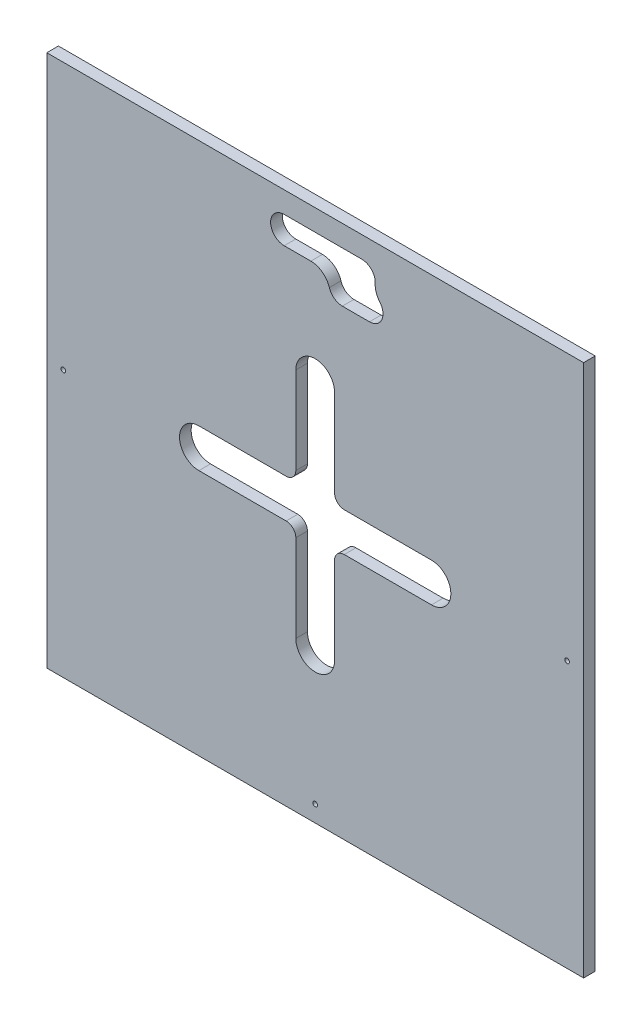
ISO-10303-21;
HEADER;
FILE_DESCRIPTION(('STEP AP214'),'2;1');
FILE_NAME('part.step','',(''),(''),'','','');
FILE_SCHEMA(('AUTOMOTIVE_DESIGN { 1 0 10303 214 1 1 1 1 }'));
ENDSEC;
DATA;
#1=APPLICATION_CONTEXT('core data for automotive mechanical design processes');
#2=APPLICATION_PROTOCOL_DEFINITION('international standard','automotive_design',2000,#1);
#3=PRODUCT_CONTEXT('',#1,'mechanical');
#4=PRODUCT('Part','Part','',(#3));
#5=PRODUCT_RELATED_PRODUCT_CATEGORY('part','',(#4));
#6=PRODUCT_DEFINITION_FORMATION('','',#4);
#7=PRODUCT_DEFINITION_CONTEXT('part definition',#1,'design');
#8=PRODUCT_DEFINITION('design','',#6,#7);
#9=PRODUCT_DEFINITION_SHAPE('','',#8);
#10=(LENGTH_UNIT() NAMED_UNIT(*) SI_UNIT(.MILLI.,.METRE.));
#11=(NAMED_UNIT(*) PLANE_ANGLE_UNIT() SI_UNIT($,.RADIAN.));
#12=(NAMED_UNIT(*) SI_UNIT($,.STERADIAN.) SOLID_ANGLE_UNIT());
#13=UNCERTAINTY_MEASURE_WITH_UNIT(LENGTH_MEASURE(1.E-05),#10,'distance_accuracy_value','');
#14=(GEOMETRIC_REPRESENTATION_CONTEXT(3) GLOBAL_UNCERTAINTY_ASSIGNED_CONTEXT((#13)) GLOBAL_UNIT_ASSIGNED_CONTEXT((#10,
#11,#12)) REPRESENTATION_CONTEXT('',''));
#15=CARTESIAN_POINT('',(0.,0.,0.));
#16=DIRECTION('',(0.,0.,1.));
#17=DIRECTION('',(1.,0.,0.));
#18=AXIS2_PLACEMENT_3D('',#15,#16,#17);
#19=CARTESIAN_POINT('',(-9.99999999999998,60.,0.));
#20=DIRECTION('',(-1.,0.,0.));
#21=DIRECTION('',(0.,-1.,0.));
#22=AXIS2_PLACEMENT_3D('',#19,#20,#21);
#23=PLANE('',#22);
#24=DIRECTION('',(0.,1.,0.));
#25=VECTOR('',#24,1.);
#26=CARTESIAN_POINT('',(-9.99999999999998,60.,0.));
#27=LINE('',#26,#25);
#28=CARTESIAN_POINT('',(-9.99999999999999,15.0000000000001,0.));
#29=VERTEX_POINT('',#28);
#30=CARTESIAN_POINT('',(-9.99999999999998,60.,0.));
#31=VERTEX_POINT('',#30);
#32=EDGE_CURVE('E292',#29,#31,#27,.T.);
#33=ORIENTED_EDGE('',*,*,#32,.F.);
#34=DIRECTION('',(0.,0.,-1.));
#35=VECTOR('',#34,1.);
#36=CARTESIAN_POINT('',(-9.99999999999999,15.0000000000001,0.));
#37=LINE('',#36,#35);
#38=CARTESIAN_POINT('',(-9.99999999999999,15.0000000000001,-6.));
#39=VERTEX_POINT('',#38);
#40=EDGE_CURVE('E452',#29,#39,#37,.T.);
#41=ORIENTED_EDGE('',*,*,#40,.T.);
#42=DIRECTION('',(0.,1.,0.));
#43=VECTOR('',#42,1.);
#44=CARTESIAN_POINT('',(-9.99999999999998,60.,-6.));
#45=LINE('',#44,#43);
#46=CARTESIAN_POINT('',(-9.99999999999998,60.,-6.));
#47=VERTEX_POINT('',#46);
#48=EDGE_CURVE('E305',#39,#47,#45,.T.);
#49=ORIENTED_EDGE('',*,*,#48,.T.);
#50=DIRECTION('',(0.,0.,-1.));
#51=VECTOR('',#50,1.);
#52=CARTESIAN_POINT('',(-9.99999999999998,60.,0.));
#53=LINE('',#52,#51);
#54=EDGE_CURVE('E308',#31,#47,#53,.T.);
#55=ORIENTED_EDGE('',*,*,#54,.F.);
#56=EDGE_LOOP('',(#33,#41,#49,#55));
#57=FACE_BOUND('',#56,.T.);
#58=ADVANCED_FACE('F38',(#57),#23,.F.);
#59=CARTESIAN_POINT('',(10.,60.,0.));
#60=DIRECTION('',(1.,0.,0.));
#61=DIRECTION('',(0.,1.,0.));
#62=AXIS2_PLACEMENT_3D('',#59,#60,#61);
#63=PLANE('',#62);
#64=DIRECTION('',(0.,-1.,0.));
#65=VECTOR('',#64,1.);
#66=CARTESIAN_POINT('',(10.,60.,-6.));
#67=LINE('',#66,#65);
#68=CARTESIAN_POINT('',(10.,60.,-6.));
#69=VERTEX_POINT('',#68);
#70=CARTESIAN_POINT('',(10.,14.9999999999999,-6.));
#71=VERTEX_POINT('',#70);
#72=EDGE_CURVE('E299',#69,#71,#67,.T.);
#73=ORIENTED_EDGE('',*,*,#72,.T.);
#74=DIRECTION('',(0.,0.,1.));
#75=VECTOR('',#74,1.);
#76=CARTESIAN_POINT('',(10.,14.9999999999999,0.));
#77=LINE('',#76,#75);
#78=CARTESIAN_POINT('',(10.,14.9999999999999,0.));
#79=VERTEX_POINT('',#78);
#80=EDGE_CURVE('E46',#71,#79,#77,.T.);
#81=ORIENTED_EDGE('',*,*,#80,.T.);
#82=DIRECTION('',(0.,-1.,0.));
#83=VECTOR('',#82,1.);
#84=CARTESIAN_POINT('',(10.,60.,0.));
#85=LINE('',#84,#83);
#86=CARTESIAN_POINT('',(10.,60.,0.));
#87=VERTEX_POINT('',#86);
#88=EDGE_CURVE('E286',#87,#79,#85,.T.);
#89=ORIENTED_EDGE('',*,*,#88,.F.);
#90=DIRECTION('',(0.,0.,-1.));
#91=VECTOR('',#90,1.);
#92=CARTESIAN_POINT('',(10.,60.,0.));
#93=LINE('',#92,#91);
#94=EDGE_CURVE('E296',#87,#69,#93,.T.);
#95=ORIENTED_EDGE('',*,*,#94,.T.);
#96=EDGE_LOOP('',(#73,#81,#89,#95));
#97=FACE_BOUND('',#96,.T.);
#98=ADVANCED_FACE('F463',(#97),#63,.F.);
#99=CARTESIAN_POINT('',(138.5,137.5,-6.));
#100=DIRECTION('',(1.,0.,0.));
#101=DIRECTION('',(0.,1.,0.));
#102=AXIS2_PLACEMENT_3D('',#99,#100,#101);
#103=PLANE('',#102);
#104=DIRECTION('',(0.,1.,0.));
#105=VECTOR('',#104,1.);
#106=CARTESIAN_POINT('',(138.5,137.5,0.));
#107=LINE('',#106,#105);
#108=CARTESIAN_POINT('',(138.5,-137.5,0.));
#109=VERTEX_POINT('',#108);
#110=CARTESIAN_POINT('',(138.5,137.5,0.));
#111=VERTEX_POINT('',#110);
#112=EDGE_CURVE('E359',#109,#111,#107,.T.);
#113=ORIENTED_EDGE('',*,*,#112,.F.);
#114=DIRECTION('',(0.,0.,1.));
#115=VECTOR('',#114,1.);
#116=CARTESIAN_POINT('',(138.5,-137.5,-6.));
#117=LINE('',#116,#115);
#118=CARTESIAN_POINT('',(138.5,-137.5,-6.));
#119=VERTEX_POINT('',#118);
#120=EDGE_CURVE('E392',#119,#109,#117,.T.);
#121=ORIENTED_EDGE('',*,*,#120,.F.);
#122=DIRECTION('',(0.,1.,0.));
#123=VECTOR('',#122,1.);
#124=CARTESIAN_POINT('',(138.5,137.5,-6.));
#125=LINE('',#124,#123);
#126=CARTESIAN_POINT('',(138.5,137.5,-6.));
#127=VERTEX_POINT('',#126);
#128=EDGE_CURVE('E368',#119,#127,#125,.T.);
#129=ORIENTED_EDGE('',*,*,#128,.T.);
#130=DIRECTION('',(0.,0.,1.));
#131=VECTOR('',#130,1.);
#132=CARTESIAN_POINT('',(138.5,137.5,-6.));
#133=LINE('',#132,#131);
#134=EDGE_CURVE('E381',#127,#111,#133,.T.);
#135=ORIENTED_EDGE('',*,*,#134,.T.);
#136=EDGE_LOOP('',(#113,#121,#129,#135));
#137=FACE_BOUND('',#136,.T.);
#138=ADVANCED_FACE('F531',(#137),#103,.T.);
#139=CARTESIAN_POINT('',(-138.5,-137.5,-6.));
#140=DIRECTION('',(0.,-1.,0.));
#141=DIRECTION('',(0.,0.,-1.));
#142=AXIS2_PLACEMENT_3D('',#139,#140,#141);
#143=PLANE('',#142);
#144=DIRECTION('',(1.,0.,0.));
#145=VECTOR('',#144,1.);
#146=CARTESIAN_POINT('',(-138.5,-137.5,0.));
#147=LINE('',#146,#145);
#148=CARTESIAN_POINT('',(-138.5,-137.5,0.));
#149=VERTEX_POINT('',#148);
#150=EDGE_CURVE('E372',#149,#109,#147,.T.);
#151=ORIENTED_EDGE('',*,*,#150,.F.);
#152=DIRECTION('',(0.,0.,1.));
#153=VECTOR('',#152,1.);
#154=CARTESIAN_POINT('',(-138.5,-137.5,-6.));
#155=LINE('',#154,#153);
#156=CARTESIAN_POINT('',(-138.5,-137.5,-6.));
#157=VERTEX_POINT('',#156);
#158=EDGE_CURVE('E395',#157,#149,#155,.T.);
#159=ORIENTED_EDGE('',*,*,#158,.F.);
#160=DIRECTION('',(1.,0.,0.));
#161=VECTOR('',#160,1.);
#162=CARTESIAN_POINT('',(-138.5,-137.5,-6.));
#163=LINE('',#162,#161);
#164=EDGE_CURVE('E378',#157,#119,#163,.T.);
#165=ORIENTED_EDGE('',*,*,#164,.T.);
#166=ORIENTED_EDGE('',*,*,#120,.T.);
#167=EDGE_LOOP('',(#151,#159,#165,#166));
#168=FACE_BOUND('',#167,.T.);
#169=ADVANCED_FACE('F590',(#168),#143,.T.);
#170=CARTESIAN_POINT('',(-138.5,137.5,-6.));
#171=DIRECTION('',(-1.,0.,0.));
#172=DIRECTION('',(0.,-1.,0.));
#173=AXIS2_PLACEMENT_3D('',#170,#171,#172);
#174=PLANE('',#173);
#175=DIRECTION('',(0.,-1.,0.));
#176=VECTOR('',#175,1.);
#177=CARTESIAN_POINT('',(-138.5,137.5,0.));
#178=LINE('',#177,#176);
#179=CARTESIAN_POINT('',(-138.5,137.5,0.));
#180=VERTEX_POINT('',#179);
#181=EDGE_CURVE('E387',#180,#149,#178,.T.);
#182=ORIENTED_EDGE('',*,*,#181,.F.);
#183=DIRECTION('',(0.,0.,1.));
#184=VECTOR('',#183,1.);
#185=CARTESIAN_POINT('',(-138.5,137.5,-6.));
#186=LINE('',#185,#184);
#187=CARTESIAN_POINT('',(-138.5,137.5,-6.));
#188=VERTEX_POINT('',#187);
#189=EDGE_CURVE('E397',#188,#180,#186,.T.);
#190=ORIENTED_EDGE('',*,*,#189,.F.);
#191=DIRECTION('',(0.,-1.,0.));
#192=VECTOR('',#191,1.);
#193=CARTESIAN_POINT('',(-138.5,137.5,-6.));
#194=LINE('',#193,#192);
#195=EDGE_CURVE('E375',#188,#157,#194,.T.);
#196=ORIENTED_EDGE('',*,*,#195,.T.);
#197=ORIENTED_EDGE('',*,*,#158,.T.);
#198=EDGE_LOOP('',(#182,#190,#196,#197));
#199=FACE_BOUND('',#198,.T.);
#200=ADVANCED_FACE('F593',(#199),#174,.T.);
#201=CARTESIAN_POINT('',(-138.5,137.5,-6.));
#202=DIRECTION('',(0.,1.,0.));
#203=DIRECTION('',(0.,0.,1.));
#204=AXIS2_PLACEMENT_3D('',#201,#202,#203);
#205=PLANE('',#204);
#206=DIRECTION('',(-1.,0.,0.));
#207=VECTOR('',#206,1.);
#208=CARTESIAN_POINT('',(-138.5,137.5,0.));
#209=LINE('',#208,#207);
#210=EDGE_CURVE('E384',#111,#180,#209,.T.);
#211=ORIENTED_EDGE('',*,*,#210,.F.);
#212=ORIENTED_EDGE('',*,*,#134,.F.);
#213=DIRECTION('',(-1.,0.,0.));
#214=VECTOR('',#213,1.);
#215=CARTESIAN_POINT('',(-138.5,137.5,-6.));
#216=LINE('',#215,#214);
#217=EDGE_CURVE('E371',#127,#188,#216,.T.);
#218=ORIENTED_EDGE('',*,*,#217,.T.);
#219=ORIENTED_EDGE('',*,*,#189,.T.);
#220=EDGE_LOOP('',(#211,#212,#218,#219));
#221=FACE_BOUND('',#220,.T.);
#222=ADVANCED_FACE('F587',(#221),#205,.T.);
#223=CARTESIAN_POINT('',(0.,0.,-6.));
#224=DIRECTION('',(0.,0.,1.));
#225=DIRECTION('',(1.,0.,0.));
#226=AXIS2_PLACEMENT_3D('',#223,#224,#225);
#227=PLANE('',#226);
#228=CARTESIAN_POINT('',(10.,-15.0000000000001,-6.));
#229=VERTEX_POINT('',#228);
#230=CARTESIAN_POINT('',(9.99999999999999,-60.,-6.));
#231=VERTEX_POINT('',#230);
#232=EDGE_CURVE('E298',#229,#231,#67,.T.);
#233=ORIENTED_EDGE('',*,*,#232,.F.);
#234=CARTESIAN_POINT('',(15.,-15.0000000000001,-6.));
#235=DIRECTION('',(0.,0.,1.));
#236=DIRECTION('',(1.,0.,0.));
#237=AXIS2_PLACEMENT_3D('',#234,#235,#236);
#238=CIRCLE('',#237,5.);
#239=CARTESIAN_POINT('',(15.,-10.0000000000001,-6.));
#240=VERTEX_POINT('',#239);
#241=EDGE_CURVE('E443',#229,#240,#238,.F.);
#242=ORIENTED_EDGE('',*,*,#241,.T.);
#243=DIRECTION('',(-1.,0.,0.));
#244=VECTOR('',#243,1.);
#245=CARTESIAN_POINT('',(60.,-10.0000000000002,-6.));
#246=LINE('',#245,#244);
#247=CARTESIAN_POINT('',(60.,-10.0000000000002,-6.));
#248=VERTEX_POINT('',#247);
#249=EDGE_CURVE('E269',#248,#240,#246,.T.);
#250=ORIENTED_EDGE('',*,*,#249,.F.);
#251=CARTESIAN_POINT('',(60.,-2.31775225258214E-13,-6.));
#252=DIRECTION('',(0.,0.,-1.));
#253=DIRECTION('',(0.,1.,0.));
#254=AXIS2_PLACEMENT_3D('',#251,#252,#253);
#255=CIRCLE('',#254,10.);
#256=CARTESIAN_POINT('',(60.,9.99999999999977,-6.));
#257=VERTEX_POINT('',#256);
#258=EDGE_CURVE('E237',#257,#248,#255,.T.);
#259=ORIENTED_EDGE('',*,*,#258,.F.);
#260=DIRECTION('',(1.,0.,0.));
#261=VECTOR('',#260,1.);
#262=CARTESIAN_POINT('',(60.,9.99999999999977,-6.));
#263=LINE('',#262,#261);
#264=CARTESIAN_POINT('',(15.,9.99999999999994,-6.));
#265=VERTEX_POINT('',#264);
#266=EDGE_CURVE('E261',#265,#257,#263,.T.);
#267=ORIENTED_EDGE('',*,*,#266,.F.);
#268=CARTESIAN_POINT('',(15.,14.9999999999999,-6.));
#269=DIRECTION('',(0.,0.,1.));
#270=DIRECTION('',(1.,0.,0.));
#271=AXIS2_PLACEMENT_3D('',#268,#269,#270);
#272=CIRCLE('',#271,5.);
#273=EDGE_CURVE('E437',#265,#71,#272,.F.);
#274=ORIENTED_EDGE('',*,*,#273,.T.);
#275=ORIENTED_EDGE('',*,*,#72,.F.);
#276=CARTESIAN_POINT('',(0.,60.,-6.));
#277=DIRECTION('',(0.,0.,-1.));
#278=DIRECTION('',(-1.,0.,0.));
#279=AXIS2_PLACEMENT_3D('',#276,#277,#278);
#280=CIRCLE('',#279,10.);
#281=EDGE_CURVE('E276',#47,#69,#280,.T.);
#282=ORIENTED_EDGE('',*,*,#281,.F.);
#283=ORIENTED_EDGE('',*,*,#48,.F.);
#284=CARTESIAN_POINT('',(-15.,15.0000000000001,-6.));
#285=DIRECTION('',(0.,0.,1.));
#286=DIRECTION('',(1.,0.,0.));
#287=AXIS2_PLACEMENT_3D('',#284,#285,#286);
#288=CIRCLE('',#287,5.);
#289=CARTESIAN_POINT('',(-15.,10.0000000000001,-6.));
#290=VERTEX_POINT('',#289);
#291=EDGE_CURVE('E441',#39,#290,#288,.F.);
#292=ORIENTED_EDGE('',*,*,#291,.T.);
#293=CARTESIAN_POINT('',(-60.,10.0000000000002,-6.));
#294=VERTEX_POINT('',#293);
#295=EDGE_CURVE('E258',#294,#290,#263,.T.);
#296=ORIENTED_EDGE('',*,*,#295,.F.);
#297=CARTESIAN_POINT('',(-60.,2.23941939377383E-13,-6.));
#298=DIRECTION('',(0.,0.,-1.));
#299=DIRECTION('',(0.,1.,0.));
#300=AXIS2_PLACEMENT_3D('',#297,#298,#299);
#301=CIRCLE('',#300,10.);
#302=CARTESIAN_POINT('',(-60.,-9.99999999999978,-6.));
#303=VERTEX_POINT('',#302);
#304=EDGE_CURVE('E271',#303,#294,#301,.T.);
#305=ORIENTED_EDGE('',*,*,#304,.F.);
#306=CARTESIAN_POINT('',(-15.,-9.99999999999995,-6.));
#307=VERTEX_POINT('',#306);
#308=EDGE_CURVE('E268',#307,#303,#246,.T.);
#309=ORIENTED_EDGE('',*,*,#308,.F.);
#310=CARTESIAN_POINT('',(-15.,-14.9999999999999,-6.));
#311=DIRECTION('',(0.,0.,1.));
#312=DIRECTION('',(1.,0.,0.));
#313=AXIS2_PLACEMENT_3D('',#310,#311,#312);
#314=CIRCLE('',#313,5.);
#315=CARTESIAN_POINT('',(-10.,-14.9999999999999,-6.));
#316=VERTEX_POINT('',#315);
#317=EDGE_CURVE('E439',#307,#316,#314,.F.);
#318=ORIENTED_EDGE('',*,*,#317,.T.);
#319=CARTESIAN_POINT('',(-10.,-60.,-6.));
#320=VERTEX_POINT('',#319);
#321=EDGE_CURVE('E285',#320,#316,#45,.T.);
#322=ORIENTED_EDGE('',*,*,#321,.F.);
#323=CARTESIAN_POINT('',(0.,-60.,-6.));
#324=DIRECTION('',(0.,0.,-1.));
#325=DIRECTION('',(-1.,0.,0.));
#326=AXIS2_PLACEMENT_3D('',#323,#324,#325);
#327=CIRCLE('',#326,10.);
#328=EDGE_CURVE('E302',#231,#320,#327,.T.);
#329=ORIENTED_EDGE('',*,*,#328,.F.);
#330=EDGE_LOOP('',(#233,#242,#250,#259,#267,#274,#275,#282,#283,#292,#296,#305,#309,#318,#322,#329));
#331=FACE_BOUND('',#330,.T.);
#332=CARTESIAN_POINT('',(130.,0.,-6.));
#333=DIRECTION('',(0.,0.,-1.));
#334=DIRECTION('',(-1.,0.,0.));
#335=AXIS2_PLACEMENT_3D('',#332,#333,#334);
#336=CIRCLE('',#335,1.20000000000001);
#337=CARTESIAN_POINT('',(128.8,0.,-6.));
#338=VERTEX_POINT('',#337);
#339=EDGE_CURVE('E311',#338,#338,#336,.T.);
#340=ORIENTED_EDGE('',*,*,#339,.F.);
#341=EDGE_LOOP('',(#340));
#342=FACE_BOUND('',#341,.T.);
#343=CARTESIAN_POINT('',(-130.,0.,-6.));
#344=DIRECTION('',(0.,0.,-1.));
#345=DIRECTION('',(-1.,0.,0.));
#346=AXIS2_PLACEMENT_3D('',#343,#344,#345);
#347=CIRCLE('',#346,1.20000000000001);
#348=CARTESIAN_POINT('',(-131.2,0.,-6.));
#349=VERTEX_POINT('',#348);
#350=EDGE_CURVE('E324',#349,#349,#347,.T.);
#351=ORIENTED_EDGE('',*,*,#350,.F.);
#352=EDGE_LOOP('',(#351));
#353=FACE_BOUND('',#352,.T.);
#354=CARTESIAN_POINT('',(0.,-129.,-6.));
#355=DIRECTION('',(0.,0.,-1.));
#356=DIRECTION('',(-1.,0.,0.));
#357=AXIS2_PLACEMENT_3D('',#354,#355,#356);
#358=CIRCLE('',#357,1.2);
#359=CARTESIAN_POINT('',(-1.2,-129.,-6.));
#360=VERTEX_POINT('',#359);
#361=EDGE_CURVE('E330',#360,#360,#358,.T.);
#362=ORIENTED_EDGE('',*,*,#361,.F.);
#363=EDGE_LOOP('',(#362));
#364=FACE_BOUND('',#363,.T.);
#365=CARTESIAN_POINT('',(28.,107.5,-6.));
#366=DIRECTION('',(0.,0.,-1.));
#367=DIRECTION('',(-1.,0.,0.));
#368=AXIS2_PLACEMENT_3D('',#365,#366,#367);
#369=CIRCLE('',#368,6.99999999999999);
#370=CARTESIAN_POINT('',(33.3405758575851,112.025289991744,-6.));
#371=VERTEX_POINT('',#370);
#372=CARTESIAN_POINT('',(28.,100.5,-6.));
#373=VERTEX_POINT('',#372);
#374=EDGE_CURVE('E339',#371,#373,#369,.T.);
#375=ORIENTED_EDGE('',*,*,#374,.F.);
#376=CARTESIAN_POINT('',(40.9699699398496,118.48998997995,-6.));
#377=DIRECTION('',(0.,0.,1.));
#378=DIRECTION('',(1.,0.,0.));
#379=AXIS2_PLACEMENT_3D('',#376,#377,#378);
#380=CIRCLE('',#379,10.);
#381=CARTESIAN_POINT('',(30.9876346811145,119.084113521156,-6.));
#382=VERTEX_POINT('',#381);
#383=EDGE_CURVE('E421',#371,#382,#380,.F.);
#384=ORIENTED_EDGE('',*,*,#383,.T.);
#385=CARTESIAN_POINT('',(24.,119.5,-6.));
#386=DIRECTION('',(0.,0.,-1.));
#387=DIRECTION('',(-1.,0.,0.));
#388=AXIS2_PLACEMENT_3D('',#385,#386,#387);
#389=CIRCLE('',#388,6.99999999999999);
#390=CARTESIAN_POINT('',(24.,126.5,-6.));
#391=VERTEX_POINT('',#390);
#392=EDGE_CURVE('E336',#391,#382,#389,.T.);
#393=ORIENTED_EDGE('',*,*,#392,.F.);
#394=DIRECTION('',(1.,0.,0.));
#395=VECTOR('',#394,1.);
#396=CARTESIAN_POINT('',(0.,126.5,-6.));
#397=LINE('',#396,#395);
#398=CARTESIAN_POINT('',(-16.,126.5,-6.));
#399=VERTEX_POINT('',#398);
#400=EDGE_CURVE('E353',#399,#391,#397,.T.);
#401=ORIENTED_EDGE('',*,*,#400,.F.);
#402=CARTESIAN_POINT('',(-16.,119.5,-6.));
#403=DIRECTION('',(0.,0.,-1.));
#404=DIRECTION('',(-1.,0.,0.));
#405=AXIS2_PLACEMENT_3D('',#402,#403,#404);
#406=CIRCLE('',#405,6.99999999999999);
#407=CARTESIAN_POINT('',(-16.,112.5,-6.));
#408=VERTEX_POINT('',#407);
#409=EDGE_CURVE('E350',#408,#399,#406,.T.);
#410=ORIENTED_EDGE('',*,*,#409,.F.);
#411=DIRECTION('',(1.,0.,0.));
#412=VECTOR('',#411,1.);
#413=CARTESIAN_POINT('',(0.,112.5,-6.));
#414=LINE('',#413,#412);
#415=CARTESIAN_POINT('',(-2.24807680927197,112.5,-6.));
#416=VERTEX_POINT('',#415);
#417=EDGE_CURVE('E347',#408,#416,#414,.T.);
#418=ORIENTED_EDGE('',*,*,#417,.T.);
#419=CARTESIAN_POINT('',(-2.24807680927197,102.5,-6.));
#420=DIRECTION('',(0.,0.,1.));
#421=DIRECTION('',(1.,0.,0.));
#422=AXIS2_PLACEMENT_3D('',#419,#420,#421);
#423=CIRCLE('',#422,10.);
#424=CARTESIAN_POINT('',(7.30961543147623,105.441176470588,-6.));
#425=VERTEX_POINT('',#424);
#426=EDGE_CURVE('E419',#416,#425,#423,.F.);
#427=ORIENTED_EDGE('',*,*,#426,.T.);
#428=CARTESIAN_POINT('',(14.,107.5,-6.));
#429=DIRECTION('',(0.,0.,-1.));
#430=DIRECTION('',(-1.,0.,0.));
#431=AXIS2_PLACEMENT_3D('',#428,#429,#430);
#432=CIRCLE('',#431,6.99999999999999);
#433=CARTESIAN_POINT('',(14.,100.5,-6.));
#434=VERTEX_POINT('',#433);
#435=EDGE_CURVE('E344',#434,#425,#432,.T.);
#436=ORIENTED_EDGE('',*,*,#435,.F.);
#437=DIRECTION('',(1.,0.,0.));
#438=VECTOR('',#437,1.);
#439=CARTESIAN_POINT('',(0.,100.5,-6.));
#440=LINE('',#439,#438);
#441=EDGE_CURVE('E341',#434,#373,#440,.T.);
#442=ORIENTED_EDGE('',*,*,#441,.T.);
#443=EDGE_LOOP('',(#375,#384,#393,#401,#410,#418,#427,#436,#442));
#444=FACE_BOUND('',#443,.T.);
#445=ORIENTED_EDGE('',*,*,#128,.F.);
#446=ORIENTED_EDGE('',*,*,#164,.F.);
#447=ORIENTED_EDGE('',*,*,#195,.F.);
#448=ORIENTED_EDGE('',*,*,#217,.F.);
#449=EDGE_LOOP('',(#445,#446,#447,#448));
#450=FACE_BOUND('',#449,.T.);
#451=ADVANCED_FACE('F473',(#331,#342,#353,#364,#444,#450),#227,.F.);
#452=CARTESIAN_POINT('',(0.,0.,0.));
#453=DIRECTION('',(0.,0.,1.));
#454=DIRECTION('',(1.,0.,0.));
#455=AXIS2_PLACEMENT_3D('',#452,#453,#454);
#456=PLANE('',#455);
#457=DIRECTION('',(-1.,0.,0.));
#458=VECTOR('',#457,1.);
#459=CARTESIAN_POINT('',(60.,-10.0000000000002,0.));
#460=LINE('',#459,#458);
#461=CARTESIAN_POINT('',(60.,-10.0000000000002,0.));
#462=VERTEX_POINT('',#461);
#463=CARTESIAN_POINT('',(15.,-10.0000000000001,0.));
#464=VERTEX_POINT('',#463);
#465=EDGE_CURVE('E245',#462,#464,#460,.T.);
#466=ORIENTED_EDGE('',*,*,#465,.T.);
#467=CARTESIAN_POINT('',(15.,-15.0000000000001,0.));
#468=DIRECTION('',(0.,0.,1.));
#469=DIRECTION('',(1.,0.,0.));
#470=AXIS2_PLACEMENT_3D('',#467,#468,#469);
#471=CIRCLE('',#470,5.);
#472=CARTESIAN_POINT('',(10.,-15.0000000000001,0.));
#473=VERTEX_POINT('',#472);
#474=EDGE_CURVE('E450',#464,#473,#471,.T.);
#475=ORIENTED_EDGE('',*,*,#474,.T.);
#476=CARTESIAN_POINT('',(9.99999999999999,-60.,0.));
#477=VERTEX_POINT('',#476);
#478=EDGE_CURVE('E284',#473,#477,#85,.T.);
#479=ORIENTED_EDGE('',*,*,#478,.T.);
#480=CARTESIAN_POINT('',(0.,-60.,0.));
#481=DIRECTION('',(0.,0.,-1.));
#482=DIRECTION('',(-1.,0.,0.));
#483=AXIS2_PLACEMENT_3D('',#480,#481,#482);
#484=CIRCLE('',#483,10.);
#485=CARTESIAN_POINT('',(-10.,-60.,0.));
#486=VERTEX_POINT('',#485);
#487=EDGE_CURVE('E289',#477,#486,#484,.T.);
#488=ORIENTED_EDGE('',*,*,#487,.T.);
#489=CARTESIAN_POINT('',(-10.,-14.9999999999999,0.));
#490=VERTEX_POINT('',#489);
#491=EDGE_CURVE('E293',#486,#490,#27,.T.);
#492=ORIENTED_EDGE('',*,*,#491,.T.);
#493=CARTESIAN_POINT('',(-15.,-14.9999999999999,0.));
#494=DIRECTION('',(0.,0.,1.));
#495=DIRECTION('',(1.,0.,0.));
#496=AXIS2_PLACEMENT_3D('',#493,#494,#495);
#497=CIRCLE('',#496,5.);
#498=CARTESIAN_POINT('',(-15.,-9.99999999999995,0.));
#499=VERTEX_POINT('',#498);
#500=EDGE_CURVE('E447',#490,#499,#497,.T.);
#501=ORIENTED_EDGE('',*,*,#500,.T.);
#502=CARTESIAN_POINT('',(-60.,-9.99999999999978,0.));
#503=VERTEX_POINT('',#502);
#504=EDGE_CURVE('E251',#499,#503,#460,.T.);
#505=ORIENTED_EDGE('',*,*,#504,.T.);
#506=CARTESIAN_POINT('',(-60.,2.23941939377383E-13,0.));
#507=DIRECTION('',(0.,0.,-1.));
#508=DIRECTION('',(0.,1.,0.));
#509=AXIS2_PLACEMENT_3D('',#506,#507,#508);
#510=CIRCLE('',#509,10.);
#511=CARTESIAN_POINT('',(-60.,10.0000000000002,0.));
#512=VERTEX_POINT('',#511);
#513=EDGE_CURVE('E250',#503,#512,#510,.T.);
#514=ORIENTED_EDGE('',*,*,#513,.T.);
#515=DIRECTION('',(1.,0.,0.));
#516=VECTOR('',#515,1.);
#517=CARTESIAN_POINT('',(60.,9.99999999999977,0.));
#518=LINE('',#517,#516);
#519=CARTESIAN_POINT('',(-15.,10.0000000000001,0.));
#520=VERTEX_POINT('',#519);
#521=EDGE_CURVE('E242',#512,#520,#518,.T.);
#522=ORIENTED_EDGE('',*,*,#521,.T.);
#523=CARTESIAN_POINT('',(-15.,15.0000000000001,0.));
#524=DIRECTION('',(0.,0.,1.));
#525=DIRECTION('',(1.,0.,0.));
#526=AXIS2_PLACEMENT_3D('',#523,#524,#525);
#527=CIRCLE('',#526,5.);
#528=EDGE_CURVE('E61',#520,#29,#527,.T.);
#529=ORIENTED_EDGE('',*,*,#528,.T.);
#530=ORIENTED_EDGE('',*,*,#32,.T.);
#531=CARTESIAN_POINT('',(0.,60.,0.));
#532=DIRECTION('',(0.,0.,-1.));
#533=DIRECTION('',(-1.,0.,0.));
#534=AXIS2_PLACEMENT_3D('',#531,#532,#533);
#535=CIRCLE('',#534,10.);
#536=EDGE_CURVE('E281',#31,#87,#535,.T.);
#537=ORIENTED_EDGE('',*,*,#536,.T.);
#538=ORIENTED_EDGE('',*,*,#88,.T.);
#539=CARTESIAN_POINT('',(15.,14.9999999999999,0.));
#540=DIRECTION('',(0.,0.,1.));
#541=DIRECTION('',(1.,0.,0.));
#542=AXIS2_PLACEMENT_3D('',#539,#540,#541);
#543=CIRCLE('',#542,5.);
#544=CARTESIAN_POINT('',(15.,9.99999999999994,0.));
#545=VERTEX_POINT('',#544);
#546=EDGE_CURVE('E53',#79,#545,#543,.T.);
#547=ORIENTED_EDGE('',*,*,#546,.T.);
#548=CARTESIAN_POINT('',(60.,9.99999999999977,0.));
#549=VERTEX_POINT('',#548);
#550=EDGE_CURVE('E256',#545,#549,#518,.T.);
#551=ORIENTED_EDGE('',*,*,#550,.T.);
#552=CARTESIAN_POINT('',(60.,-2.31775225258214E-13,0.));
#553=DIRECTION('',(0.,0.,-1.));
#554=DIRECTION('',(0.,1.,0.));
#555=AXIS2_PLACEMENT_3D('',#552,#553,#554);
#556=CIRCLE('',#555,10.);
#557=EDGE_CURVE('E235',#549,#462,#556,.T.);
#558=ORIENTED_EDGE('',*,*,#557,.T.);
#559=EDGE_LOOP('',(#466,#475,#479,#488,#492,#501,#505,#514,#522,#529,#530,#537,#538,#547,#551,#558));
#560=FACE_BOUND('',#559,.T.);
#561=CARTESIAN_POINT('',(130.,0.,0.));
#562=DIRECTION('',(0.,0.,-1.));
#563=DIRECTION('',(-1.,0.,0.));
#564=AXIS2_PLACEMENT_3D('',#561,#562,#563);
#565=CIRCLE('',#564,1.20000000000001);
#566=CARTESIAN_POINT('',(128.8,0.,0.));
#567=VERTEX_POINT('',#566);
#568=EDGE_CURVE('E321',#567,#567,#565,.T.);
#569=ORIENTED_EDGE('',*,*,#568,.T.);
#570=EDGE_LOOP('',(#569));
#571=FACE_BOUND('',#570,.T.);
#572=CARTESIAN_POINT('',(-130.,0.,0.));
#573=DIRECTION('',(0.,0.,-1.));
#574=DIRECTION('',(-1.,0.,0.));
#575=AXIS2_PLACEMENT_3D('',#572,#573,#574);
#576=CIRCLE('',#575,1.20000000000001);
#577=CARTESIAN_POINT('',(-131.2,0.,0.));
#578=VERTEX_POINT('',#577);
#579=EDGE_CURVE('E327',#578,#578,#576,.T.);
#580=ORIENTED_EDGE('',*,*,#579,.T.);
#581=EDGE_LOOP('',(#580));
#582=FACE_BOUND('',#581,.T.);
#583=CARTESIAN_POINT('',(0.,-129.,0.));
#584=DIRECTION('',(0.,0.,-1.));
#585=DIRECTION('',(-1.,0.,0.));
#586=AXIS2_PLACEMENT_3D('',#583,#584,#585);
#587=CIRCLE('',#586,1.2);
#588=CARTESIAN_POINT('',(-1.2,-129.,0.));
#589=VERTEX_POINT('',#588);
#590=EDGE_CURVE('E333',#589,#589,#587,.T.);
#591=ORIENTED_EDGE('',*,*,#590,.T.);
#592=EDGE_LOOP('',(#591));
#593=FACE_BOUND('',#592,.T.);
#594=CARTESIAN_POINT('',(24.,119.5,0.));
#595=DIRECTION('',(0.,0.,1.));
#596=DIRECTION('',(1.,0.,0.));
#597=AXIS2_PLACEMENT_3D('',#594,#595,#596);
#598=CIRCLE('',#597,6.99999999999999);
#599=CARTESIAN_POINT('',(30.9876346811145,119.084113521156,0.));
#600=VERTEX_POINT('',#599);
#601=CARTESIAN_POINT('',(24.,126.5,0.));
#602=VERTEX_POINT('',#601);
#603=EDGE_CURVE('E414',#600,#602,#598,.T.);
#604=ORIENTED_EDGE('',*,*,#603,.F.);
#605=CARTESIAN_POINT('',(40.9699699398496,118.48998997995,0.));
#606=DIRECTION('',(0.,0.,1.));
#607=DIRECTION('',(1.,0.,0.));
#608=AXIS2_PLACEMENT_3D('',#605,#606,#607);
#609=CIRCLE('',#608,10.);
#610=CARTESIAN_POINT('',(33.3405758575851,112.025289991744,0.));
#611=VERTEX_POINT('',#610);
#612=EDGE_CURVE('E427',#600,#611,#609,.T.);
#613=ORIENTED_EDGE('',*,*,#612,.T.);
#614=CARTESIAN_POINT('',(28.,107.5,0.));
#615=DIRECTION('',(0.,0.,1.));
#616=DIRECTION('',(1.,0.,0.));
#617=AXIS2_PLACEMENT_3D('',#614,#615,#616);
#618=CIRCLE('',#617,6.99999999999999);
#619=CARTESIAN_POINT('',(28.,100.5,0.));
#620=VERTEX_POINT('',#619);
#621=EDGE_CURVE('E394',#620,#611,#618,.T.);
#622=ORIENTED_EDGE('',*,*,#621,.F.);
#623=DIRECTION('',(-1.,0.,0.));
#624=VECTOR('',#623,1.);
#625=CARTESIAN_POINT('',(0.,100.5,0.));
#626=LINE('',#625,#624);
#627=CARTESIAN_POINT('',(14.,100.5,0.));
#628=VERTEX_POINT('',#627);
#629=EDGE_CURVE('E402',#620,#628,#626,.T.);
#630=ORIENTED_EDGE('',*,*,#629,.T.);
#631=CARTESIAN_POINT('',(14.,107.5,0.));
#632=DIRECTION('',(0.,0.,1.));
#633=DIRECTION('',(1.,0.,0.));
#634=AXIS2_PLACEMENT_3D('',#631,#632,#633);
#635=CIRCLE('',#634,6.99999999999999);
#636=CARTESIAN_POINT('',(7.30961543147623,105.441176470588,0.));
#637=VERTEX_POINT('',#636);
#638=EDGE_CURVE('E405',#637,#628,#635,.T.);
#639=ORIENTED_EDGE('',*,*,#638,.F.);
#640=CARTESIAN_POINT('',(-2.24807680927197,102.5,0.));
#641=DIRECTION('',(0.,0.,1.));
#642=DIRECTION('',(1.,0.,0.));
#643=AXIS2_PLACEMENT_3D('',#640,#641,#642);
#644=CIRCLE('',#643,10.);
#645=CARTESIAN_POINT('',(-2.24807680927197,112.5,0.));
#646=VERTEX_POINT('',#645);
#647=EDGE_CURVE('E425',#637,#646,#644,.T.);
#648=ORIENTED_EDGE('',*,*,#647,.T.);
#649=DIRECTION('',(-1.,0.,0.));
#650=VECTOR('',#649,1.);
#651=CARTESIAN_POINT('',(0.,112.5,0.));
#652=LINE('',#651,#650);
#653=CARTESIAN_POINT('',(-16.,112.5,0.));
#654=VERTEX_POINT('',#653);
#655=EDGE_CURVE('E407',#646,#654,#652,.T.);
#656=ORIENTED_EDGE('',*,*,#655,.T.);
#657=CARTESIAN_POINT('',(-16.,119.5,0.));
#658=DIRECTION('',(0.,0.,1.));
#659=DIRECTION('',(1.,0.,0.));
#660=AXIS2_PLACEMENT_3D('',#657,#658,#659);
#661=CIRCLE('',#660,6.99999999999999);
#662=CARTESIAN_POINT('',(-16.,126.5,0.));
#663=VERTEX_POINT('',#662);
#664=EDGE_CURVE('E409',#663,#654,#661,.T.);
#665=ORIENTED_EDGE('',*,*,#664,.F.);
#666=DIRECTION('',(-1.,0.,0.));
#667=VECTOR('',#666,1.);
#668=CARTESIAN_POINT('',(0.,126.5,0.));
#669=LINE('',#668,#667);
#670=EDGE_CURVE('E412',#602,#663,#669,.T.);
#671=ORIENTED_EDGE('',*,*,#670,.F.);
#672=EDGE_LOOP('',(#604,#613,#622,#630,#639,#648,#656,#665,#671));
#673=FACE_BOUND('',#672,.T.);
#674=ORIENTED_EDGE('',*,*,#112,.T.);
#675=ORIENTED_EDGE('',*,*,#210,.T.);
#676=ORIENTED_EDGE('',*,*,#181,.T.);
#677=ORIENTED_EDGE('',*,*,#150,.T.);
#678=EDGE_LOOP('',(#674,#675,#676,#677));
#679=FACE_BOUND('',#678,.T.);
#680=ADVANCED_FACE('F253',(#560,#571,#582,#593,#673,#679),#456,.T.);
#681=CARTESIAN_POINT('',(24.,119.5,4.));
#682=DIRECTION('',(0.,0.,-1.));
#683=DIRECTION('',(-1.,0.,0.));
#684=AXIS2_PLACEMENT_3D('',#681,#682,#683);
#685=CYLINDRICAL_SURFACE('',#684,6.99999999999999);
#686=ORIENTED_EDGE('',*,*,#392,.T.);
#687=DIRECTION('',(0.,0.,-1.));
#688=VECTOR('',#687,1.);
#689=CARTESIAN_POINT('',(30.9876346811145,119.084113521156,4.));
#690=LINE('',#689,#688);
#691=EDGE_CURVE('E423',#382,#600,#690,.F.);
#692=ORIENTED_EDGE('',*,*,#691,.T.);
#693=ORIENTED_EDGE('',*,*,#603,.T.);
#694=DIRECTION('',(0.,0.,-1.));
#695=VECTOR('',#694,1.);
#696=CARTESIAN_POINT('',(24.,126.5,4.));
#697=LINE('',#696,#695);
#698=EDGE_CURVE('E357',#602,#391,#697,.T.);
#699=ORIENTED_EDGE('',*,*,#698,.T.);
#700=EDGE_LOOP('',(#686,#692,#693,#699));
#701=FACE_BOUND('',#700,.T.);
#702=ADVANCED_FACE('F560',(#701),#685,.F.);
#703=CARTESIAN_POINT('',(0.,126.5,4.));
#704=DIRECTION('',(0.,1.,0.));
#705=DIRECTION('',(0.,0.,1.));
#706=AXIS2_PLACEMENT_3D('',#703,#704,#705);
#707=PLANE('',#706);
#708=ORIENTED_EDGE('',*,*,#670,.T.);
#709=DIRECTION('',(0.,0.,-1.));
#710=VECTOR('',#709,1.);
#711=CARTESIAN_POINT('',(-16.,126.5,4.));
#712=LINE('',#711,#710);
#713=EDGE_CURVE('E360',#663,#399,#712,.T.);
#714=ORIENTED_EDGE('',*,*,#713,.T.);
#715=ORIENTED_EDGE('',*,*,#400,.T.);
#716=ORIENTED_EDGE('',*,*,#698,.F.);
#717=EDGE_LOOP('',(#708,#714,#715,#716));
#718=FACE_BOUND('',#717,.T.);
#719=ADVANCED_FACE('F556',(#718),#707,.F.);
#720=CARTESIAN_POINT('',(-16.,119.5,4.));
#721=DIRECTION('',(0.,0.,-1.));
#722=DIRECTION('',(-1.,0.,0.));
#723=AXIS2_PLACEMENT_3D('',#720,#721,#722);
#724=CYLINDRICAL_SURFACE('',#723,6.99999999999999);
#725=ORIENTED_EDGE('',*,*,#664,.T.);
#726=DIRECTION('',(0.,0.,-1.));
#727=VECTOR('',#726,1.);
#728=CARTESIAN_POINT('',(-16.,112.5,4.));
#729=LINE('',#728,#727);
#730=EDGE_CURVE('E362',#654,#408,#729,.T.);
#731=ORIENTED_EDGE('',*,*,#730,.T.);
#732=ORIENTED_EDGE('',*,*,#409,.T.);
#733=ORIENTED_EDGE('',*,*,#713,.F.);
#734=EDGE_LOOP('',(#725,#731,#732,#733));
#735=FACE_BOUND('',#734,.T.);
#736=ADVANCED_FACE('F559',(#735),#724,.F.);
#737=CARTESIAN_POINT('',(0.,112.5,4.));
#738=DIRECTION('',(0.,1.,0.));
#739=DIRECTION('',(0.,0.,1.));
#740=AXIS2_PLACEMENT_3D('',#737,#738,#739);
#741=PLANE('',#740);
#742=ORIENTED_EDGE('',*,*,#655,.F.);
#743=DIRECTION('',(0.,0.,1.));
#744=VECTOR('',#743,1.);
#745=CARTESIAN_POINT('',(-2.24807680927197,112.5,-6.));
#746=LINE('',#745,#744);
#747=EDGE_CURVE('E429',#646,#416,#746,.F.);
#748=ORIENTED_EDGE('',*,*,#747,.T.);
#749=ORIENTED_EDGE('',*,*,#417,.F.);
#750=ORIENTED_EDGE('',*,*,#730,.F.);
#751=EDGE_LOOP('',(#742,#748,#749,#750));
#752=FACE_BOUND('',#751,.T.);
#753=ADVANCED_FACE('F564',(#752),#741,.T.);
#754=CARTESIAN_POINT('',(14.,107.5,4.));
#755=DIRECTION('',(0.,0.,-1.));
#756=DIRECTION('',(-1.,0.,0.));
#757=AXIS2_PLACEMENT_3D('',#754,#755,#756);
#758=CYLINDRICAL_SURFACE('',#757,6.99999999999999);
#759=ORIENTED_EDGE('',*,*,#435,.T.);
#760=DIRECTION('',(0.,0.,-1.));
#761=VECTOR('',#760,1.);
#762=CARTESIAN_POINT('',(7.30961543147623,105.441176470588,4.));
#763=LINE('',#762,#761);
#764=EDGE_CURVE('E432',#425,#637,#763,.F.);
#765=ORIENTED_EDGE('',*,*,#764,.T.);
#766=ORIENTED_EDGE('',*,*,#638,.T.);
#767=DIRECTION('',(0.,0.,-1.));
#768=VECTOR('',#767,1.);
#769=CARTESIAN_POINT('',(14.,100.5,4.));
#770=LINE('',#769,#768);
#771=EDGE_CURVE('E364',#628,#434,#770,.T.);
#772=ORIENTED_EDGE('',*,*,#771,.T.);
#773=EDGE_LOOP('',(#759,#765,#766,#772));
#774=FACE_BOUND('',#773,.T.);
#775=ADVANCED_FACE('F568',(#774),#758,.F.);
#776=CARTESIAN_POINT('',(0.,100.5,4.));
#777=DIRECTION('',(0.,1.,0.));
#778=DIRECTION('',(0.,0.,1.));
#779=AXIS2_PLACEMENT_3D('',#776,#777,#778);
#780=PLANE('',#779);
#781=DIRECTION('',(0.,0.,-1.));
#782=VECTOR('',#781,1.);
#783=CARTESIAN_POINT('',(28.,100.5,4.));
#784=LINE('',#783,#782);
#785=EDGE_CURVE('E356',#620,#373,#784,.T.);
#786=ORIENTED_EDGE('',*,*,#785,.T.);
#787=ORIENTED_EDGE('',*,*,#441,.F.);
#788=ORIENTED_EDGE('',*,*,#771,.F.);
#789=ORIENTED_EDGE('',*,*,#629,.F.);
#790=EDGE_LOOP('',(#786,#787,#788,#789));
#791=FACE_BOUND('',#790,.T.);
#792=ADVANCED_FACE('F572',(#791),#780,.T.);
#793=CARTESIAN_POINT('',(28.,107.5,4.));
#794=DIRECTION('',(0.,0.,-1.));
#795=DIRECTION('',(-1.,0.,0.));
#796=AXIS2_PLACEMENT_3D('',#793,#794,#795);
#797=CYLINDRICAL_SURFACE('',#796,6.99999999999999);
#798=ORIENTED_EDGE('',*,*,#621,.T.);
#799=DIRECTION('',(0.,0.,-1.));
#800=VECTOR('',#799,1.);
#801=CARTESIAN_POINT('',(33.3405758575851,112.025289991744,4.));
#802=LINE('',#801,#800);
#803=EDGE_CURVE('E416',#611,#371,#802,.T.);
#804=ORIENTED_EDGE('',*,*,#803,.T.);
#805=ORIENTED_EDGE('',*,*,#374,.T.);
#806=ORIENTED_EDGE('',*,*,#785,.F.);
#807=EDGE_LOOP('',(#798,#804,#805,#806));
#808=FACE_BOUND('',#807,.T.);
#809=ADVANCED_FACE('F576',(#808),#797,.F.);
#810=CARTESIAN_POINT('',(40.9699699398496,118.48998997995,4.));
#811=DIRECTION('',(0.,0.,-1.));
#812=DIRECTION('',(-1.,0.,0.));
#813=AXIS2_PLACEMENT_3D('',#810,#811,#812);
#814=CYLINDRICAL_SURFACE('',#813,10.);
#815=ORIENTED_EDGE('',*,*,#612,.F.);
#816=ORIENTED_EDGE('',*,*,#691,.F.);
#817=ORIENTED_EDGE('',*,*,#383,.F.);
#818=ORIENTED_EDGE('',*,*,#803,.F.);
#819=EDGE_LOOP('',(#815,#816,#817,#818));
#820=FACE_BOUND('',#819,.T.);
#821=ADVANCED_FACE('F580',(#820),#814,.T.);
#822=CARTESIAN_POINT('',(-2.24807680927197,102.5,4.));
#823=DIRECTION('',(0.,0.,-1.));
#824=DIRECTION('',(-1.,0.,0.));
#825=AXIS2_PLACEMENT_3D('',#822,#823,#824);
#826=CYLINDRICAL_SURFACE('',#825,10.);
#827=ORIENTED_EDGE('',*,*,#647,.F.);
#828=ORIENTED_EDGE('',*,*,#764,.F.);
#829=ORIENTED_EDGE('',*,*,#426,.F.);
#830=ORIENTED_EDGE('',*,*,#747,.F.);
#831=EDGE_LOOP('',(#827,#828,#829,#830));
#832=FACE_BOUND('',#831,.T.);
#833=ADVANCED_FACE('F554',(#832),#826,.T.);
#834=CARTESIAN_POINT('',(0.,-129.,-6.));
#835=DIRECTION('',(0.,0.,-1.));
#836=DIRECTION('',(-1.,0.,0.));
#837=AXIS2_PLACEMENT_3D('',#834,#835,#836);
#838=CYLINDRICAL_SURFACE('',#837,1.2);
#839=ORIENTED_EDGE('',*,*,#590,.F.);
#840=EDGE_LOOP('',(#839));
#841=FACE_BOUND('',#840,.T.);
#842=ORIENTED_EDGE('',*,*,#361,.T.);
#843=EDGE_LOOP('',(#842));
#844=FACE_BOUND('',#843,.T.);
#845=ADVANCED_FACE('F550',(#841,#844),#838,.F.);
#846=CARTESIAN_POINT('',(-130.,0.,-6.));
#847=DIRECTION('',(0.,0.,-1.));
#848=DIRECTION('',(-1.,0.,0.));
#849=AXIS2_PLACEMENT_3D('',#846,#847,#848);
#850=CYLINDRICAL_SURFACE('',#849,1.20000000000001);
#851=ORIENTED_EDGE('',*,*,#579,.F.);
#852=EDGE_LOOP('',(#851));
#853=FACE_BOUND('',#852,.T.);
#854=ORIENTED_EDGE('',*,*,#350,.T.);
#855=EDGE_LOOP('',(#854));
#856=FACE_BOUND('',#855,.T.);
#857=ADVANCED_FACE('F544',(#853,#856),#850,.F.);
#858=CARTESIAN_POINT('',(130.,0.,-6.));
#859=DIRECTION('',(0.,0.,-1.));
#860=DIRECTION('',(-1.,0.,0.));
#861=AXIS2_PLACEMENT_3D('',#858,#859,#860);
#862=CYLINDRICAL_SURFACE('',#861,1.20000000000001);
#863=ORIENTED_EDGE('',*,*,#568,.F.);
#864=EDGE_LOOP('',(#863));
#865=FACE_BOUND('',#864,.T.);
#866=ORIENTED_EDGE('',*,*,#339,.T.);
#867=EDGE_LOOP('',(#866));
#868=FACE_BOUND('',#867,.T.);
#869=ADVANCED_FACE('F539',(#865,#868),#862,.F.);
#870=CARTESIAN_POINT('',(0.,60.,0.));
#871=DIRECTION('',(0.,0.,-1.));
#872=DIRECTION('',(-1.,0.,0.));
#873=AXIS2_PLACEMENT_3D('',#870,#871,#872);
#874=CYLINDRICAL_SURFACE('',#873,10.);
#875=ORIENTED_EDGE('',*,*,#281,.T.);
#876=ORIENTED_EDGE('',*,*,#94,.F.);
#877=ORIENTED_EDGE('',*,*,#536,.F.);
#878=ORIENTED_EDGE('',*,*,#54,.T.);
#879=EDGE_LOOP('',(#875,#876,#877,#878));
#880=FACE_BOUND('',#879,.T.);
#881=ADVANCED_FACE('F469',(#880),#874,.F.);
#882=ORIENTED_EDGE('',*,*,#321,.T.);
#883=DIRECTION('',(0.,0.,1.));
#884=VECTOR('',#883,1.);
#885=CARTESIAN_POINT('',(-10.,-14.9999999999999,0.));
#886=LINE('',#885,#884);
#887=EDGE_CURVE('E457',#316,#490,#886,.T.);
#888=ORIENTED_EDGE('',*,*,#887,.T.);
#889=ORIENTED_EDGE('',*,*,#491,.F.);
#890=DIRECTION('',(0.,0.,-1.));
#891=VECTOR('',#890,1.);
#892=CARTESIAN_POINT('',(-10.,-60.,0.));
#893=LINE('',#892,#891);
#894=EDGE_CURVE('E312',#486,#320,#893,.T.);
#895=ORIENTED_EDGE('',*,*,#894,.T.);
#896=EDGE_LOOP('',(#882,#888,#889,#895));
#897=FACE_BOUND('',#896,.T.);
#898=ADVANCED_FACE('F495',(#897),#23,.F.);
#899=CARTESIAN_POINT('',(0.,-60.,0.));
#900=DIRECTION('',(0.,0.,-1.));
#901=DIRECTION('',(-1.,0.,0.));
#902=AXIS2_PLACEMENT_3D('',#899,#900,#901);
#903=CYLINDRICAL_SURFACE('',#902,10.);
#904=ORIENTED_EDGE('',*,*,#328,.T.);
#905=ORIENTED_EDGE('',*,*,#894,.F.);
#906=ORIENTED_EDGE('',*,*,#487,.F.);
#907=DIRECTION('',(0.,0.,-1.));
#908=VECTOR('',#907,1.);
#909=CARTESIAN_POINT('',(9.99999999999999,-60.,0.));
#910=LINE('',#909,#908);
#911=EDGE_CURVE('E314',#477,#231,#910,.T.);
#912=ORIENTED_EDGE('',*,*,#911,.T.);
#913=EDGE_LOOP('',(#904,#905,#906,#912));
#914=FACE_BOUND('',#913,.T.);
#915=ADVANCED_FACE('F489',(#914),#903,.F.);
#916=ORIENTED_EDGE('',*,*,#478,.F.);
#917=DIRECTION('',(0.,0.,-1.));
#918=VECTOR('',#917,1.);
#919=CARTESIAN_POINT('',(10.,-15.0000000000001,0.));
#920=LINE('',#919,#918);
#921=EDGE_CURVE('E434',#473,#229,#920,.T.);
#922=ORIENTED_EDGE('',*,*,#921,.T.);
#923=ORIENTED_EDGE('',*,*,#232,.T.);
#924=ORIENTED_EDGE('',*,*,#911,.F.);
#925=EDGE_LOOP('',(#916,#922,#923,#924));
#926=FACE_BOUND('',#925,.T.);
#927=ADVANCED_FACE('F486',(#926),#63,.F.);
#928=CARTESIAN_POINT('',(60.,-10.0000000000002,0.));
#929=DIRECTION('',(0.,-1.,0.));
#930=DIRECTION('',(1.,0.,0.));
#931=AXIS2_PLACEMENT_3D('',#928,#929,#930);
#932=PLANE('',#931);
#933=ORIENTED_EDGE('',*,*,#249,.T.);
#934=DIRECTION('',(0.,0.,-1.));
#935=VECTOR('',#934,1.);
#936=CARTESIAN_POINT('',(15.,-10.0000000000001,0.));
#937=LINE('',#936,#935);
#938=EDGE_CURVE('E248',#240,#464,#937,.F.);
#939=ORIENTED_EDGE('',*,*,#938,.T.);
#940=ORIENTED_EDGE('',*,*,#465,.F.);
#941=DIRECTION('',(0.,0.,-1.));
#942=VECTOR('',#941,1.);
#943=CARTESIAN_POINT('',(60.,-10.0000000000002,0.));
#944=LINE('',#943,#942);
#945=EDGE_CURVE('E230',#462,#248,#944,.T.);
#946=ORIENTED_EDGE('',*,*,#945,.T.);
#947=EDGE_LOOP('',(#933,#939,#940,#946));
#948=FACE_BOUND('',#947,.T.);
#949=ADVANCED_FACE('F246',(#948),#932,.F.);
#950=CARTESIAN_POINT('',(60.,9.99999999999977,0.));
#951=DIRECTION('',(0.,1.,0.));
#952=DIRECTION('',(-1.,0.,0.));
#953=AXIS2_PLACEMENT_3D('',#950,#951,#952);
#954=PLANE('',#953);
#955=ORIENTED_EDGE('',*,*,#550,.F.);
#956=DIRECTION('',(0.,0.,1.));
#957=VECTOR('',#956,1.);
#958=CARTESIAN_POINT('',(15.,9.99999999999994,0.));
#959=LINE('',#958,#957);
#960=EDGE_CURVE('E11',#545,#265,#959,.F.);
#961=ORIENTED_EDGE('',*,*,#960,.T.);
#962=ORIENTED_EDGE('',*,*,#266,.T.);
#963=DIRECTION('',(0.,0.,-1.));
#964=VECTOR('',#963,1.);
#965=CARTESIAN_POINT('',(60.,9.99999999999977,0.));
#966=LINE('',#965,#964);
#967=EDGE_CURVE('E274',#549,#257,#966,.T.);
#968=ORIENTED_EDGE('',*,*,#967,.F.);
#969=EDGE_LOOP('',(#955,#961,#962,#968));
#970=FACE_BOUND('',#969,.T.);
#971=ADVANCED_FACE('F478',(#970),#954,.F.);
#972=CARTESIAN_POINT('',(60.,-2.31775225258214E-13,0.));
#973=DIRECTION('',(0.,0.,-1.));
#974=DIRECTION('',(-1.,0.,0.));
#975=AXIS2_PLACEMENT_3D('',#972,#973,#974);
#976=CYLINDRICAL_SURFACE('',#975,10.);
#977=ORIENTED_EDGE('',*,*,#258,.T.);
#978=ORIENTED_EDGE('',*,*,#945,.F.);
#979=ORIENTED_EDGE('',*,*,#557,.F.);
#980=ORIENTED_EDGE('',*,*,#967,.T.);
#981=EDGE_LOOP('',(#977,#978,#979,#980));
#982=FACE_BOUND('',#981,.T.);
#983=ADVANCED_FACE('F232',(#982),#976,.F.);
#984=ORIENTED_EDGE('',*,*,#295,.T.);
#985=DIRECTION('',(0.,0.,-1.));
#986=VECTOR('',#985,1.);
#987=CARTESIAN_POINT('',(-15.,10.0000000000001,0.));
#988=LINE('',#987,#986);
#989=EDGE_CURVE('E455',#290,#520,#988,.F.);
#990=ORIENTED_EDGE('',*,*,#989,.T.);
#991=ORIENTED_EDGE('',*,*,#521,.F.);
#992=DIRECTION('',(0.,0.,-1.));
#993=VECTOR('',#992,1.);
#994=CARTESIAN_POINT('',(-60.,10.0000000000002,0.));
#995=LINE('',#994,#993);
#996=EDGE_CURVE('E277',#512,#294,#995,.T.);
#997=ORIENTED_EDGE('',*,*,#996,.T.);
#998=EDGE_LOOP('',(#984,#990,#991,#997));
#999=FACE_BOUND('',#998,.T.);
#1000=ADVANCED_FACE('F516',(#999),#954,.F.);
#1001=CARTESIAN_POINT('',(-60.,2.23941939377383E-13,0.));
#1002=DIRECTION('',(0.,0.,-1.));
#1003=DIRECTION('',(-1.,0.,0.));
#1004=AXIS2_PLACEMENT_3D('',#1001,#1002,#1003);
#1005=CYLINDRICAL_SURFACE('',#1004,10.);
#1006=ORIENTED_EDGE('',*,*,#304,.T.);
#1007=ORIENTED_EDGE('',*,*,#996,.F.);
#1008=ORIENTED_EDGE('',*,*,#513,.F.);
#1009=DIRECTION('',(0.,0.,-1.));
#1010=VECTOR('',#1009,1.);
#1011=CARTESIAN_POINT('',(-60.,-9.99999999999978,0.));
#1012=LINE('',#1011,#1010);
#1013=EDGE_CURVE('E241',#503,#303,#1012,.T.);
#1014=ORIENTED_EDGE('',*,*,#1013,.T.);
#1015=EDGE_LOOP('',(#1006,#1007,#1008,#1014));
#1016=FACE_BOUND('',#1015,.T.);
#1017=ADVANCED_FACE('F507',(#1016),#1005,.F.);
#1018=ORIENTED_EDGE('',*,*,#504,.F.);
#1019=DIRECTION('',(0.,0.,1.));
#1020=VECTOR('',#1019,1.);
#1021=CARTESIAN_POINT('',(-15.,-9.99999999999995,0.));
#1022=LINE('',#1021,#1020);
#1023=EDGE_CURVE('E460',#499,#307,#1022,.F.);
#1024=ORIENTED_EDGE('',*,*,#1023,.T.);
#1025=ORIENTED_EDGE('',*,*,#308,.T.);
#1026=ORIENTED_EDGE('',*,*,#1013,.F.);
#1027=EDGE_LOOP('',(#1018,#1024,#1025,#1026));
#1028=FACE_BOUND('',#1027,.T.);
#1029=ADVANCED_FACE('F503',(#1028),#932,.F.);
#1030=CARTESIAN_POINT('',(15.,-15.0000000000001,0.));
#1031=DIRECTION('',(0.,0.,-1.));
#1032=DIRECTION('',(-1.,0.,0.));
#1033=AXIS2_PLACEMENT_3D('',#1030,#1031,#1032);
#1034=CYLINDRICAL_SURFACE('',#1033,5.);
#1035=ORIENTED_EDGE('',*,*,#474,.F.);
#1036=ORIENTED_EDGE('',*,*,#938,.F.);
#1037=ORIENTED_EDGE('',*,*,#241,.F.);
#1038=ORIENTED_EDGE('',*,*,#921,.F.);
#1039=EDGE_LOOP('',(#1035,#1036,#1037,#1038));
#1040=FACE_BOUND('',#1039,.T.);
#1041=ADVANCED_FACE('F480',(#1040),#1034,.T.);
#1042=CARTESIAN_POINT('',(-15.,15.0000000000001,0.));
#1043=DIRECTION('',(0.,0.,-1.));
#1044=DIRECTION('',(-1.,0.,0.));
#1045=AXIS2_PLACEMENT_3D('',#1042,#1043,#1044);
#1046=CYLINDRICAL_SURFACE('',#1045,5.);
#1047=ORIENTED_EDGE('',*,*,#528,.F.);
#1048=ORIENTED_EDGE('',*,*,#989,.F.);
#1049=ORIENTED_EDGE('',*,*,#291,.F.);
#1050=ORIENTED_EDGE('',*,*,#40,.F.);
#1051=EDGE_LOOP('',(#1047,#1048,#1049,#1050));
#1052=FACE_BOUND('',#1051,.T.);
#1053=ADVANCED_FACE('F513',(#1052),#1046,.T.);
#1054=CARTESIAN_POINT('',(-15.,-14.9999999999999,0.));
#1055=DIRECTION('',(0.,0.,1.));
#1056=DIRECTION('',(1.,0.,0.));
#1057=AXIS2_PLACEMENT_3D('',#1054,#1055,#1056);
#1058=CYLINDRICAL_SURFACE('',#1057,5.);
#1059=ORIENTED_EDGE('',*,*,#317,.F.);
#1060=ORIENTED_EDGE('',*,*,#1023,.F.);
#1061=ORIENTED_EDGE('',*,*,#500,.F.);
#1062=ORIENTED_EDGE('',*,*,#887,.F.);
#1063=EDGE_LOOP('',(#1059,#1060,#1061,#1062));
#1064=FACE_BOUND('',#1063,.T.);
#1065=ADVANCED_FACE('F498',(#1064),#1058,.T.);
#1066=CARTESIAN_POINT('',(15.,14.9999999999999,0.));
#1067=DIRECTION('',(0.,0.,1.));
#1068=DIRECTION('',(1.,0.,0.));
#1069=AXIS2_PLACEMENT_3D('',#1066,#1067,#1068);
#1070=CYLINDRICAL_SURFACE('',#1069,5.);
#1071=ORIENTED_EDGE('',*,*,#273,.F.);
#1072=ORIENTED_EDGE('',*,*,#960,.F.);
#1073=ORIENTED_EDGE('',*,*,#546,.F.);
#1074=ORIENTED_EDGE('',*,*,#80,.F.);
#1075=EDGE_LOOP('',(#1071,#1072,#1073,#1074));
#1076=FACE_BOUND('',#1075,.T.);
#1077=ADVANCED_FACE('F40',(#1076),#1070,.T.);
#1078=CLOSED_SHELL('',(#58,#98,#138,#169,#200,#222,#451,#680,#702,#719,#736,#753,#775,#792,#809,
#821,#833,#845,#857,#869,#881,#898,#915,#927,#949,#971,#983,#1000,#1017,#1029,#1041,#1053,#1065,#1077));
#1079=MANIFOLD_SOLID_BREP('B2',#1078);
#1080=ADVANCED_BREP_SHAPE_REPRESENTATION('',(#18,#1079),#14);
#1081=SHAPE_DEFINITION_REPRESENTATION(#9,#1080);
ENDSEC;
END-ISO-10303-21;
